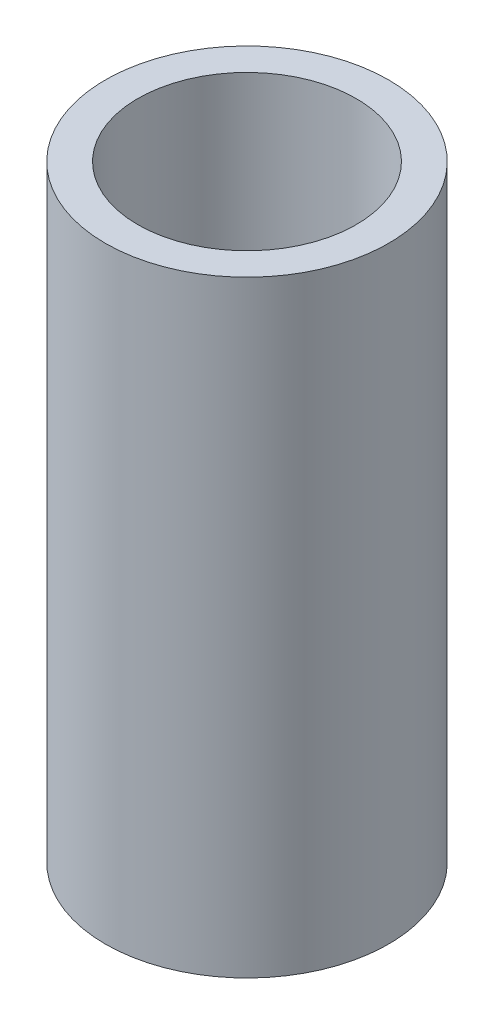
ISO-10303-21;
HEADER;
FILE_DESCRIPTION(('STEP AP214'),'2;1');
FILE_NAME('part.step','',(''),(''),'','','');
FILE_SCHEMA(('AUTOMOTIVE_DESIGN { 1 0 10303 214 1 1 1 1 }'));
ENDSEC;
DATA;
#1=APPLICATION_CONTEXT('core data for automotive mechanical design processes');
#2=APPLICATION_PROTOCOL_DEFINITION('international standard','automotive_design',2000,#1);
#3=PRODUCT_CONTEXT('',#1,'mechanical');
#4=PRODUCT('Part','Part','',(#3));
#5=PRODUCT_RELATED_PRODUCT_CATEGORY('part','',(#4));
#6=PRODUCT_DEFINITION_FORMATION('','',#4);
#7=PRODUCT_DEFINITION_CONTEXT('part definition',#1,'design');
#8=PRODUCT_DEFINITION('design','',#6,#7);
#9=PRODUCT_DEFINITION_SHAPE('','',#8);
#10=(LENGTH_UNIT() NAMED_UNIT(*) SI_UNIT(.MILLI.,.METRE.));
#11=(NAMED_UNIT(*) PLANE_ANGLE_UNIT() SI_UNIT($,.RADIAN.));
#12=(NAMED_UNIT(*) SI_UNIT($,.STERADIAN.) SOLID_ANGLE_UNIT());
#13=UNCERTAINTY_MEASURE_WITH_UNIT(LENGTH_MEASURE(1.E-05),#10,'distance_accuracy_value','');
#14=(GEOMETRIC_REPRESENTATION_CONTEXT(3) GLOBAL_UNCERTAINTY_ASSIGNED_CONTEXT((#13)) GLOBAL_UNIT_ASSIGNED_CONTEXT((#10,
#11,#12)) REPRESENTATION_CONTEXT('',''));
#15=CARTESIAN_POINT('',(0.,0.,0.));
#16=DIRECTION('',(0.,0.,1.));
#17=DIRECTION('',(1.,0.,0.));
#18=AXIS2_PLACEMENT_3D('',#15,#16,#17);
#19=CARTESIAN_POINT('',(0.,15.,0.));
#20=DIRECTION('',(0.,1.,0.));
#21=DIRECTION('',(0.,0.,1.));
#22=AXIS2_PLACEMENT_3D('',#19,#20,#21);
#23=PLANE('',#22);
#24=CARTESIAN_POINT('',(0.,15.,0.));
#25=DIRECTION('',(0.,1.,0.));
#26=DIRECTION('',(0.,0.,1.));
#27=AXIS2_PLACEMENT_3D('',#24,#25,#26);
#28=CIRCLE('',#27,3.5);
#29=CARTESIAN_POINT('',(0.,15.,3.5));
#30=VERTEX_POINT('',#29);
#31=EDGE_CURVE('E10',#30,#30,#28,.T.);
#32=ORIENTED_EDGE('',*,*,#31,.T.);
#33=EDGE_LOOP('',(#32));
#34=FACE_BOUND('',#33,.T.);
#35=CARTESIAN_POINT('',(0.,15.,0.));
#36=DIRECTION('',(0.,1.,0.));
#37=DIRECTION('',(0.,0.,1.));
#38=AXIS2_PLACEMENT_3D('',#35,#36,#37);
#39=CIRCLE('',#38,2.7);
#40=CARTESIAN_POINT('',(0.,15.,2.7));
#41=VERTEX_POINT('',#40);
#42=EDGE_CURVE('E50',#41,#41,#39,.T.);
#43=ORIENTED_EDGE('',*,*,#42,.F.);
#44=EDGE_LOOP('',(#43));
#45=FACE_BOUND('',#44,.T.);
#46=ADVANCED_FACE('F37',(#34,#45),#23,.T.);
#47=CARTESIAN_POINT('',(0.,0.,0.));
#48=DIRECTION('',(0.,1.,0.));
#49=DIRECTION('',(0.,0.,1.));
#50=AXIS2_PLACEMENT_3D('',#47,#48,#49);
#51=PLANE('',#50);
#52=CARTESIAN_POINT('',(0.,0.,0.));
#53=DIRECTION('',(0.,1.,0.));
#54=DIRECTION('',(0.,0.,1.));
#55=AXIS2_PLACEMENT_3D('',#52,#53,#54);
#56=CIRCLE('',#55,3.5);
#57=CARTESIAN_POINT('',(0.,0.,3.5));
#58=VERTEX_POINT('',#57);
#59=EDGE_CURVE('E41',#58,#58,#56,.T.);
#60=ORIENTED_EDGE('',*,*,#59,.F.);
#61=EDGE_LOOP('',(#60));
#62=FACE_BOUND('',#61,.T.);
#63=CARTESIAN_POINT('',(0.,0.,0.));
#64=DIRECTION('',(0.,1.,0.));
#65=DIRECTION('',(0.,0.,1.));
#66=AXIS2_PLACEMENT_3D('',#63,#64,#65);
#67=CIRCLE('',#66,2.7);
#68=CARTESIAN_POINT('',(0.,0.,2.7));
#69=VERTEX_POINT('',#68);
#70=EDGE_CURVE('E52',#69,#69,#67,.T.);
#71=ORIENTED_EDGE('',*,*,#70,.T.);
#72=EDGE_LOOP('',(#71));
#73=FACE_BOUND('',#72,.T.);
#74=ADVANCED_FACE('F64',(#62,#73),#51,.F.);
#75=CARTESIAN_POINT('',(0.,15.,0.));
#76=DIRECTION('',(0.,-1.,0.));
#77=DIRECTION('',(0.,0.,-1.));
#78=AXIS2_PLACEMENT_3D('',#75,#76,#77);
#79=CYLINDRICAL_SURFACE('',#78,3.5);
#80=ORIENTED_EDGE('',*,*,#31,.F.);
#81=EDGE_LOOP('',(#80));
#82=FACE_BOUND('',#81,.T.);
#83=ORIENTED_EDGE('',*,*,#59,.T.);
#84=EDGE_LOOP('',(#83));
#85=FACE_BOUND('',#84,.T.);
#86=ADVANCED_FACE('F39',(#82,#85),#79,.T.);
#87=CARTESIAN_POINT('',(0.,15.,0.));
#88=DIRECTION('',(0.,-1.,0.));
#89=DIRECTION('',(0.,0.,-1.));
#90=AXIS2_PLACEMENT_3D('',#87,#88,#89);
#91=CYLINDRICAL_SURFACE('',#90,2.7);
#92=ORIENTED_EDGE('',*,*,#42,.T.);
#93=EDGE_LOOP('',(#92));
#94=FACE_BOUND('',#93,.T.);
#95=ORIENTED_EDGE('',*,*,#70,.F.);
#96=EDGE_LOOP('',(#95));
#97=FACE_BOUND('',#96,.T.);
#98=ADVANCED_FACE('F60',(#94,#97),#91,.F.);
#99=CLOSED_SHELL('',(#46,#74,#86,#98));
#100=MANIFOLD_SOLID_BREP('B2',#99);
#101=ADVANCED_BREP_SHAPE_REPRESENTATION('',(#18,#100),#14);
#102=SHAPE_DEFINITION_REPRESENTATION(#9,#101);
ENDSEC;
END-ISO-10303-21;
